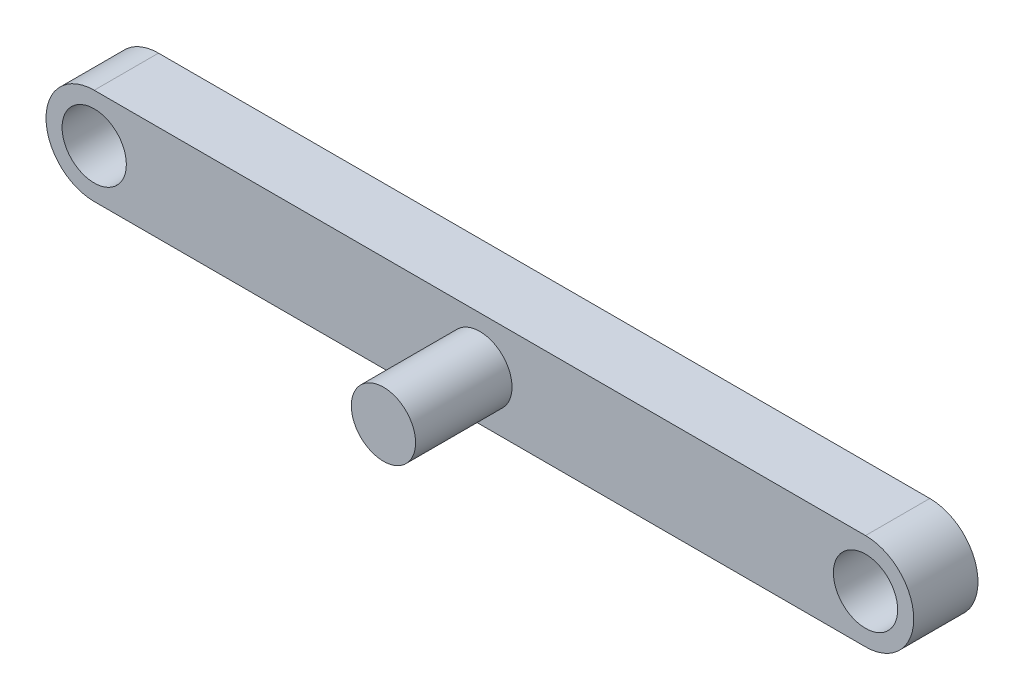
ISO-10303-21;
HEADER;
FILE_DESCRIPTION(('STEP AP214'),'2;1');
FILE_NAME('part.step','',(''),(''),'','','');
FILE_SCHEMA(('AUTOMOTIVE_DESIGN { 1 0 10303 214 1 1 1 1 }'));
ENDSEC;
DATA;
#1=APPLICATION_CONTEXT('core data for automotive mechanical design processes');
#2=APPLICATION_PROTOCOL_DEFINITION('international standard','automotive_design',2000,#1);
#3=PRODUCT_CONTEXT('',#1,'mechanical');
#4=PRODUCT('Part','Part','',(#3));
#5=PRODUCT_RELATED_PRODUCT_CATEGORY('part','',(#4));
#6=PRODUCT_DEFINITION_FORMATION('','',#4);
#7=PRODUCT_DEFINITION_CONTEXT('part definition',#1,'design');
#8=PRODUCT_DEFINITION('design','',#6,#7);
#9=PRODUCT_DEFINITION_SHAPE('','',#8);
#10=(LENGTH_UNIT() NAMED_UNIT(*) SI_UNIT(.MILLI.,.METRE.));
#11=(NAMED_UNIT(*) PLANE_ANGLE_UNIT() SI_UNIT($,.RADIAN.));
#12=(NAMED_UNIT(*) SI_UNIT($,.STERADIAN.) SOLID_ANGLE_UNIT());
#13=UNCERTAINTY_MEASURE_WITH_UNIT(LENGTH_MEASURE(1.E-05),#10,'distance_accuracy_value','');
#14=(GEOMETRIC_REPRESENTATION_CONTEXT(3) GLOBAL_UNCERTAINTY_ASSIGNED_CONTEXT((#13)) GLOBAL_UNIT_ASSIGNED_CONTEXT((#10,
#11,#12)) REPRESENTATION_CONTEXT('',''));
#15=CARTESIAN_POINT('',(0.,0.,0.));
#16=DIRECTION('',(0.,0.,1.));
#17=DIRECTION('',(1.,0.,0.));
#18=AXIS2_PLACEMENT_3D('',#15,#16,#17);
#19=CARTESIAN_POINT('',(-24.,0.,4.));
#20=DIRECTION('',(0.,0.,1.));
#21=DIRECTION('',(1.,0.,0.));
#22=AXIS2_PLACEMENT_3D('',#19,#20,#21);
#23=PLANE('',#22);
#24=CARTESIAN_POINT('',(24.,0.,4.));
#25=DIRECTION('',(0.,0.,1.));
#26=DIRECTION('',(1.,0.,0.));
#27=AXIS2_PLACEMENT_3D('',#24,#25,#26);
#28=CIRCLE('',#27,2.);
#29=CARTESIAN_POINT('',(26.,0.,4.));
#30=VERTEX_POINT('',#29);
#31=EDGE_CURVE('E114',#30,#30,#28,.T.);
#32=ORIENTED_EDGE('',*,*,#31,.F.);
#33=EDGE_LOOP('',(#32));
#34=FACE_BOUND('',#33,.T.);
#35=CARTESIAN_POINT('',(-24.,0.,4.));
#36=DIRECTION('',(0.,0.,1.));
#37=DIRECTION('',(1.,0.,0.));
#38=AXIS2_PLACEMENT_3D('',#35,#36,#37);
#39=CIRCLE('',#38,3.);
#40=CARTESIAN_POINT('',(-24.,3.,4.));
#41=VERTEX_POINT('',#40);
#42=CARTESIAN_POINT('',(-24.,-3.,4.));
#43=VERTEX_POINT('',#42);
#44=EDGE_CURVE('E84',#41,#43,#39,.T.);
#45=ORIENTED_EDGE('',*,*,#44,.T.);
#46=DIRECTION('',(1.,0.,0.));
#47=VECTOR('',#46,1.);
#48=CARTESIAN_POINT('',(-24.,-3.,4.));
#49=LINE('',#48,#47);
#50=CARTESIAN_POINT('',(24.,-3.,4.));
#51=VERTEX_POINT('',#50);
#52=EDGE_CURVE('E79',#43,#51,#49,.T.);
#53=ORIENTED_EDGE('',*,*,#52,.T.);
#54=CARTESIAN_POINT('',(24.,0.,4.));
#55=DIRECTION('',(0.,0.,1.));
#56=DIRECTION('',(1.,0.,0.));
#57=AXIS2_PLACEMENT_3D('',#54,#55,#56);
#58=CIRCLE('',#57,3.);
#59=CARTESIAN_POINT('',(24.,3.,4.));
#60=VERTEX_POINT('',#59);
#61=EDGE_CURVE('E82',#51,#60,#58,.T.);
#62=ORIENTED_EDGE('',*,*,#61,.T.);
#63=DIRECTION('',(-1.,0.,0.));
#64=VECTOR('',#63,1.);
#65=CARTESIAN_POINT('',(-24.,3.,4.));
#66=LINE('',#65,#64);
#67=EDGE_CURVE('E49',#60,#41,#66,.T.);
#68=ORIENTED_EDGE('',*,*,#67,.T.);
#69=EDGE_LOOP('',(#45,#53,#62,#68));
#70=FACE_BOUND('',#69,.T.);
#71=CARTESIAN_POINT('',(-24.,0.,4.));
#72=DIRECTION('',(0.,0.,1.));
#73=DIRECTION('',(1.,0.,0.));
#74=AXIS2_PLACEMENT_3D('',#71,#72,#73);
#75=CIRCLE('',#74,2.);
#76=CARTESIAN_POINT('',(-22.,0.,4.));
#77=VERTEX_POINT('',#76);
#78=EDGE_CURVE('E99',#77,#77,#75,.T.);
#79=ORIENTED_EDGE('',*,*,#78,.F.);
#80=EDGE_LOOP('',(#79));
#81=FACE_BOUND('',#80,.T.);
#82=CARTESIAN_POINT('',(0.,0.,4.));
#83=DIRECTION('',(0.,0.,1.));
#84=DIRECTION('',(1.,0.,0.));
#85=AXIS2_PLACEMENT_3D('',#82,#83,#84);
#86=CIRCLE('',#85,2.);
#87=CARTESIAN_POINT('',(2.,0.,4.));
#88=VERTEX_POINT('',#87);
#89=EDGE_CURVE('E120',#88,#88,#86,.T.);
#90=ORIENTED_EDGE('',*,*,#89,.F.);
#91=EDGE_LOOP('',(#90));
#92=FACE_BOUND('',#91,.T.);
#93=ADVANCED_FACE('F32',(#34,#70,#81,#92),#23,.T.);
#94=CARTESIAN_POINT('',(-24.,0.,0.));
#95=DIRECTION('',(0.,0.,1.));
#96=DIRECTION('',(1.,0.,0.));
#97=AXIS2_PLACEMENT_3D('',#94,#95,#96);
#98=PLANE('',#97);
#99=CARTESIAN_POINT('',(24.,0.,0.));
#100=DIRECTION('',(0.,0.,1.));
#101=DIRECTION('',(1.,0.,0.));
#102=AXIS2_PLACEMENT_3D('',#99,#100,#101);
#103=CIRCLE('',#102,2.);
#104=CARTESIAN_POINT('',(26.,0.,0.));
#105=VERTEX_POINT('',#104);
#106=EDGE_CURVE('E117',#105,#105,#103,.T.);
#107=ORIENTED_EDGE('',*,*,#106,.T.);
#108=EDGE_LOOP('',(#107));
#109=FACE_BOUND('',#108,.T.);
#110=CARTESIAN_POINT('',(-24.,0.,0.));
#111=DIRECTION('',(0.,0.,1.));
#112=DIRECTION('',(1.,0.,0.));
#113=AXIS2_PLACEMENT_3D('',#110,#111,#112);
#114=CIRCLE('',#113,3.);
#115=CARTESIAN_POINT('',(-24.,3.,0.));
#116=VERTEX_POINT('',#115);
#117=CARTESIAN_POINT('',(-24.,-3.,0.));
#118=VERTEX_POINT('',#117);
#119=EDGE_CURVE('E96',#116,#118,#114,.T.);
#120=ORIENTED_EDGE('',*,*,#119,.F.);
#121=DIRECTION('',(-1.,0.,0.));
#122=VECTOR('',#121,1.);
#123=CARTESIAN_POINT('',(-24.,3.,0.));
#124=LINE('',#123,#122);
#125=CARTESIAN_POINT('',(24.,3.,0.));
#126=VERTEX_POINT('',#125);
#127=EDGE_CURVE('E72',#126,#116,#124,.T.);
#128=ORIENTED_EDGE('',*,*,#127,.F.);
#129=CARTESIAN_POINT('',(24.,0.,0.));
#130=DIRECTION('',(0.,0.,1.));
#131=DIRECTION('',(1.,0.,0.));
#132=AXIS2_PLACEMENT_3D('',#129,#130,#131);
#133=CIRCLE('',#132,3.);
#134=CARTESIAN_POINT('',(24.,-3.,0.));
#135=VERTEX_POINT('',#134);
#136=EDGE_CURVE('E66',#135,#126,#133,.T.);
#137=ORIENTED_EDGE('',*,*,#136,.F.);
#138=DIRECTION('',(1.,0.,0.));
#139=VECTOR('',#138,1.);
#140=CARTESIAN_POINT('',(-24.,-3.,0.));
#141=LINE('',#140,#139);
#142=EDGE_CURVE('E88',#118,#135,#141,.T.);
#143=ORIENTED_EDGE('',*,*,#142,.F.);
#144=EDGE_LOOP('',(#120,#128,#137,#143));
#145=FACE_BOUND('',#144,.T.);
#146=CARTESIAN_POINT('',(-24.,0.,0.));
#147=DIRECTION('',(0.,0.,1.));
#148=DIRECTION('',(1.,0.,0.));
#149=AXIS2_PLACEMENT_3D('',#146,#147,#148);
#150=CIRCLE('',#149,2.);
#151=CARTESIAN_POINT('',(-22.,0.,0.));
#152=VERTEX_POINT('',#151);
#153=EDGE_CURVE('E111',#152,#152,#150,.T.);
#154=ORIENTED_EDGE('',*,*,#153,.T.);
#155=EDGE_LOOP('',(#154));
#156=FACE_BOUND('',#155,.T.);
#157=ADVANCED_FACE('F107',(#109,#145,#156),#98,.F.);
#158=CARTESIAN_POINT('',(-24.,0.,4.));
#159=DIRECTION('',(0.,0.,-1.));
#160=DIRECTION('',(-1.,0.,0.));
#161=AXIS2_PLACEMENT_3D('',#158,#159,#160);
#162=CYLINDRICAL_SURFACE('',#161,3.);
#163=ORIENTED_EDGE('',*,*,#119,.T.);
#164=DIRECTION('',(0.,0.,-1.));
#165=VECTOR('',#164,1.);
#166=CARTESIAN_POINT('',(-24.,-3.,4.));
#167=LINE('',#166,#165);
#168=EDGE_CURVE('E11',#43,#118,#167,.T.);
#169=ORIENTED_EDGE('',*,*,#168,.F.);
#170=ORIENTED_EDGE('',*,*,#44,.F.);
#171=DIRECTION('',(0.,0.,-1.));
#172=VECTOR('',#171,1.);
#173=CARTESIAN_POINT('',(-24.,3.,4.));
#174=LINE('',#173,#172);
#175=EDGE_CURVE('E92',#41,#116,#174,.T.);
#176=ORIENTED_EDGE('',*,*,#175,.T.);
#177=EDGE_LOOP('',(#163,#169,#170,#176));
#178=FACE_BOUND('',#177,.T.);
#179=ADVANCED_FACE('F34',(#178),#162,.T.);
#180=CARTESIAN_POINT('',(-24.,-3.,4.));
#181=DIRECTION('',(0.,1.,0.));
#182=DIRECTION('',(0.,0.,1.));
#183=AXIS2_PLACEMENT_3D('',#180,#181,#182);
#184=PLANE('',#183);
#185=ORIENTED_EDGE('',*,*,#142,.T.);
#186=DIRECTION('',(0.,0.,-1.));
#187=VECTOR('',#186,1.);
#188=CARTESIAN_POINT('',(24.,-3.,4.));
#189=LINE('',#188,#187);
#190=EDGE_CURVE('E41',#51,#135,#189,.T.);
#191=ORIENTED_EDGE('',*,*,#190,.F.);
#192=ORIENTED_EDGE('',*,*,#52,.F.);
#193=ORIENTED_EDGE('',*,*,#168,.T.);
#194=EDGE_LOOP('',(#185,#191,#192,#193));
#195=FACE_BOUND('',#194,.T.);
#196=ADVANCED_FACE('F87',(#195),#184,.F.);
#197=CARTESIAN_POINT('',(24.,0.,4.));
#198=DIRECTION('',(0.,0.,-1.));
#199=DIRECTION('',(-1.,0.,0.));
#200=AXIS2_PLACEMENT_3D('',#197,#198,#199);
#201=CYLINDRICAL_SURFACE('',#200,3.);
#202=ORIENTED_EDGE('',*,*,#136,.T.);
#203=DIRECTION('',(0.,0.,-1.));
#204=VECTOR('',#203,1.);
#205=CARTESIAN_POINT('',(24.,3.,4.));
#206=LINE('',#205,#204);
#207=EDGE_CURVE('E89',#60,#126,#206,.T.);
#208=ORIENTED_EDGE('',*,*,#207,.F.);
#209=ORIENTED_EDGE('',*,*,#61,.F.);
#210=ORIENTED_EDGE('',*,*,#190,.T.);
#211=EDGE_LOOP('',(#202,#208,#209,#210));
#212=FACE_BOUND('',#211,.T.);
#213=ADVANCED_FACE('F90',(#212),#201,.T.);
#214=CARTESIAN_POINT('',(-24.,3.,4.));
#215=DIRECTION('',(0.,-1.,0.));
#216=DIRECTION('',(0.,0.,-1.));
#217=AXIS2_PLACEMENT_3D('',#214,#215,#216);
#218=PLANE('',#217);
#219=ORIENTED_EDGE('',*,*,#127,.T.);
#220=ORIENTED_EDGE('',*,*,#175,.F.);
#221=ORIENTED_EDGE('',*,*,#67,.F.);
#222=ORIENTED_EDGE('',*,*,#207,.T.);
#223=EDGE_LOOP('',(#219,#220,#221,#222));
#224=FACE_BOUND('',#223,.T.);
#225=ADVANCED_FACE('F104',(#224),#218,.F.);
#226=CARTESIAN_POINT('',(-24.,0.,4.));
#227=DIRECTION('',(0.,0.,-1.));
#228=DIRECTION('',(-1.,0.,0.));
#229=AXIS2_PLACEMENT_3D('',#226,#227,#228);
#230=CYLINDRICAL_SURFACE('',#229,2.);
#231=ORIENTED_EDGE('',*,*,#78,.T.);
#232=EDGE_LOOP('',(#231));
#233=FACE_BOUND('',#232,.T.);
#234=ORIENTED_EDGE('',*,*,#153,.F.);
#235=EDGE_LOOP('',(#234));
#236=FACE_BOUND('',#235,.T.);
#237=ADVANCED_FACE('F141',(#233,#236),#230,.F.);
#238=CARTESIAN_POINT('',(24.,0.,4.));
#239=DIRECTION('',(0.,0.,-1.));
#240=DIRECTION('',(-1.,0.,0.));
#241=AXIS2_PLACEMENT_3D('',#238,#239,#240);
#242=CYLINDRICAL_SURFACE('',#241,2.);
#243=ORIENTED_EDGE('',*,*,#31,.T.);
#244=EDGE_LOOP('',(#243));
#245=FACE_BOUND('',#244,.T.);
#246=ORIENTED_EDGE('',*,*,#106,.F.);
#247=EDGE_LOOP('',(#246));
#248=FACE_BOUND('',#247,.T.);
#249=ADVANCED_FACE('F133',(#245,#248),#242,.F.);
#250=CARTESIAN_POINT('',(0.,0.,10.));
#251=DIRECTION('',(0.,0.,-1.));
#252=DIRECTION('',(-1.,0.,0.));
#253=AXIS2_PLACEMENT_3D('',#250,#251,#252);
#254=CYLINDRICAL_SURFACE('',#253,2.);
#255=ORIENTED_EDGE('',*,*,#89,.T.);
#256=EDGE_LOOP('',(#255));
#257=FACE_BOUND('',#256,.T.);
#258=CARTESIAN_POINT('',(0.,0.,10.));
#259=DIRECTION('',(0.,0.,1.));
#260=DIRECTION('',(1.,0.,0.));
#261=AXIS2_PLACEMENT_3D('',#258,#259,#260);
#262=CIRCLE('',#261,2.);
#263=CARTESIAN_POINT('',(2.,0.,10.));
#264=VERTEX_POINT('',#263);
#265=EDGE_CURVE('E125',#264,#264,#262,.T.);
#266=ORIENTED_EDGE('',*,*,#265,.F.);
#267=EDGE_LOOP('',(#266));
#268=FACE_BOUND('',#267,.T.);
#269=ADVANCED_FACE('F131',(#257,#268),#254,.T.);
#270=CARTESIAN_POINT('',(0.,0.,10.));
#271=DIRECTION('',(0.,0.,1.));
#272=DIRECTION('',(1.,0.,0.));
#273=AXIS2_PLACEMENT_3D('',#270,#271,#272);
#274=PLANE('',#273);
#275=ORIENTED_EDGE('',*,*,#265,.T.);
#276=EDGE_LOOP('',(#275));
#277=FACE_BOUND('',#276,.T.);
#278=ADVANCED_FACE('F129',(#277),#274,.T.);
#279=CLOSED_SHELL('',(#93,#157,#179,#196,#213,#225,#237,#249,#269,#278));
#280=MANIFOLD_SOLID_BREP('B2',#279);
#281=ADVANCED_BREP_SHAPE_REPRESENTATION('',(#18,#280),#14);
#282=SHAPE_DEFINITION_REPRESENTATION(#9,#281);
ENDSEC;
END-ISO-10303-21;
